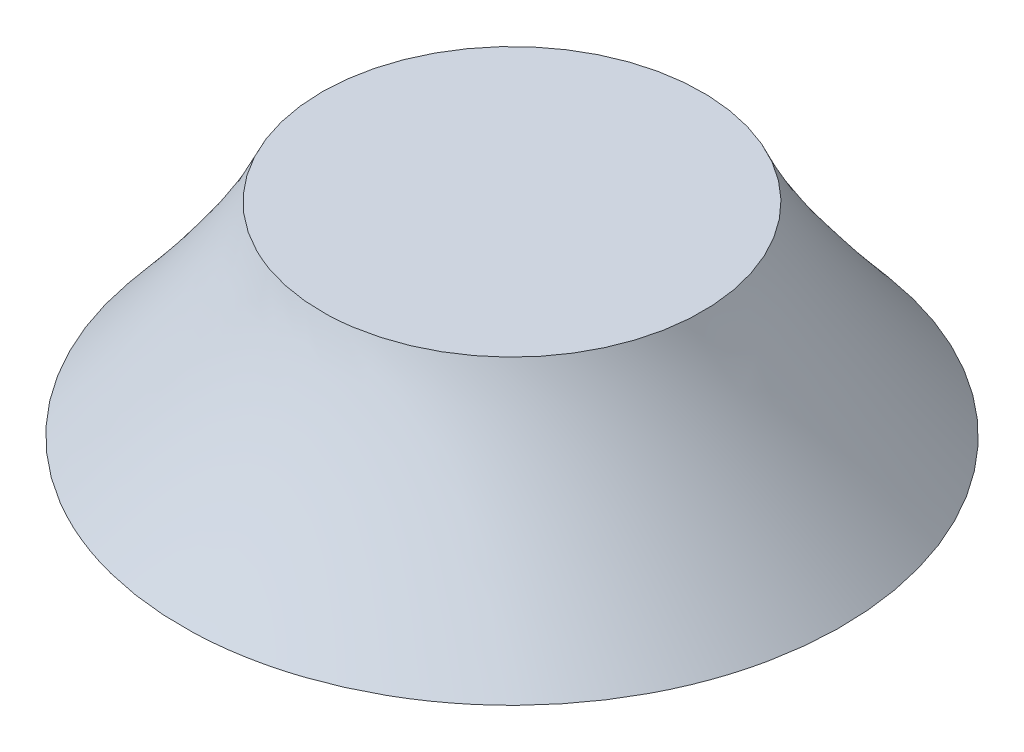
ISO-10303-21;
HEADER;
FILE_DESCRIPTION(('STEP AP214'),'2;1');
FILE_NAME('part.step','',(''),(''),'','','');
FILE_SCHEMA(('AUTOMOTIVE_DESIGN { 1 0 10303 214 1 1 1 1 }'));
ENDSEC;
DATA;
#1=APPLICATION_CONTEXT('core data for automotive mechanical design processes');
#2=APPLICATION_PROTOCOL_DEFINITION('international standard','automotive_design',2000,#1);
#3=PRODUCT_CONTEXT('',#1,'mechanical');
#4=PRODUCT('Part','Part','',(#3));
#5=PRODUCT_RELATED_PRODUCT_CATEGORY('part','',(#4));
#6=PRODUCT_DEFINITION_FORMATION('','',#4);
#7=PRODUCT_DEFINITION_CONTEXT('part definition',#1,'design');
#8=PRODUCT_DEFINITION('design','',#6,#7);
#9=PRODUCT_DEFINITION_SHAPE('','',#8);
#10=(LENGTH_UNIT() NAMED_UNIT(*) SI_UNIT(.MILLI.,.METRE.));
#11=(NAMED_UNIT(*) PLANE_ANGLE_UNIT() SI_UNIT($,.RADIAN.));
#12=(NAMED_UNIT(*) SI_UNIT($,.STERADIAN.) SOLID_ANGLE_UNIT());
#13=UNCERTAINTY_MEASURE_WITH_UNIT(LENGTH_MEASURE(1.E-05),#10,'distance_accuracy_value','');
#14=(GEOMETRIC_REPRESENTATION_CONTEXT(3) GLOBAL_UNCERTAINTY_ASSIGNED_CONTEXT((#13)) GLOBAL_UNIT_ASSIGNED_CONTEXT((#10,
#11,#12)) REPRESENTATION_CONTEXT('',''));
#15=CARTESIAN_POINT('',(0.,0.,0.));
#16=DIRECTION('',(0.,0.,1.));
#17=DIRECTION('',(1.,0.,0.));
#18=AXIS2_PLACEMENT_3D('',#15,#16,#17);
#19=CARTESIAN_POINT('',(0.,80.,0.));
#20=DIRECTION('',(0.,1.,0.));
#21=DIRECTION('',(0.,0.,1.));
#22=AXIS2_PLACEMENT_3D('',#19,#20,#21);
#23=PLANE('',#22);
#24=CARTESIAN_POINT('',(0.,80.,0.));
#25=DIRECTION('',(0.,1.,0.));
#26=DIRECTION('',(0.,0.,1.));
#27=AXIS2_PLACEMENT_3D('',#24,#25,#26);
#28=CIRCLE('',#27,75.);
#29=CARTESIAN_POINT('',(11.6394882057949,80.,-74.0913106531877));
#30=VERTEX_POINT('',#29);
#31=EDGE_CURVE('E11',#30,#30,#28,.T.);
#32=ORIENTED_EDGE('',*,*,#31,.T.);
#33=EDGE_LOOP('',(#32));
#34=FACE_BOUND('',#33,.T.);
#35=ADVANCED_FACE('F45',(#34),#23,.T.);
#36=CARTESIAN_POINT('',(0.,0.,0.));
#37=DIRECTION('',(0.,1.,0.));
#38=DIRECTION('',(0.,0.,1.));
#39=AXIS2_PLACEMENT_3D('',#36,#37,#38);
#40=PLANE('',#39);
#41=CARTESIAN_POINT('',(0.,0.,0.));
#42=DIRECTION('',(0.,1.,0.));
#43=DIRECTION('',(0.,0.,1.));
#44=AXIS2_PLACEMENT_3D('',#41,#42,#43);
#45=CIRCLE('',#44,130.);
#46=CARTESIAN_POINT('',(-52.6020180249039,0.,-118.882411229364));
#47=VERTEX_POINT('',#46);
#48=EDGE_CURVE('E54',#47,#47,#45,.T.);
#49=ORIENTED_EDGE('',*,*,#48,.F.);
#50=EDGE_LOOP('',(#49));
#51=FACE_BOUND('',#50,.T.);
#52=ADVANCED_FACE('F78',(#51),#40,.F.);
#53=CARTESIAN_POINT('',(-52.6020180249039,0.,-118.882411229364));
#54=CARTESIAN_POINT('',(11.6394882057949,80.,-74.0913106531877));
#55=CARTESIAN_POINT('',(-290.366840483633,0.,-13.6783751795564));
#56=CARTESIAN_POINT('',(-136.543133100581,80.,-97.3702870647776));
#57=CARTESIAN_POINT('',(-185.162804433825,0.,224.086447279172));
#58=CARTESIAN_POINT('',(-159.82210951217,80.,50.8123342415979));
#59=CARTESIAN_POINT('',(52.602018024904,0.,118.882411229364));
#60=CARTESIAN_POINT('',(-11.6394882057949,80.,74.0913106531877));
#61=CARTESIAN_POINT('',(290.366840483632,0.,13.6783751795563));
#62=CARTESIAN_POINT('',(136.54313310058,80.,97.3702870647775));
#63=CARTESIAN_POINT('',(185.162804433825,0.,-224.086447279172));
#64=CARTESIAN_POINT('',(159.82210951217,80.,-50.8123342415979));
#65=CARTESIAN_POINT('',(-52.6020180249039,0.,-118.882411229364));
#66=CARTESIAN_POINT('',(11.6394882057949,80.,-74.0913106531877));
#67=(BOUNDED_SURFACE() B_SPLINE_SURFACE(3,1,((#53,#54),(#55,#56),(#57,#58),(#59,#60),(#61,#62),
(#63,#64),(#65,#66)),.UNSPECIFIED.,.T.,.F.,.F.) B_SPLINE_SURFACE_WITH_KNOTS((4,3,4),(2,2),(0.,
0.5,1.),(0.,1.),.UNSPECIFIED.) GEOMETRIC_REPRESENTATION_ITEM() RATIONAL_B_SPLINE_SURFACE(((1.,
1.),(0.333333333333333,0.333333333333333),(0.333333333333333,0.333333333333333),(1.,1.),
(0.333333333333333,0.333333333333333),(0.333333333333333,0.333333333333333),(1.,1.))) REPRESENTATION_ITEM('') SURFACE());
#68=CARTESIAN_POINT('',(-52.6020180249039,0.,-118.882411229364));
#69=CARTESIAN_POINT('',(-51.9328356683341,0.833333333333335,-118.415837265029));
#70=CARTESIAN_POINT('',(-51.2636533117644,1.66666666666667,-117.949263300694));
#71=CARTESIAN_POINT('',(-49.9252885986248,3.33333333333333,-117.016115372024));
#72=CARTESIAN_POINT('',(-49.256106242055,4.16666666666667,-116.549541407688));
#73=CARTESIAN_POINT('',(-47.9177415289155,5.83333333333333,-115.616393479018));
#74=CARTESIAN_POINT('',(-47.2485591723457,6.66666666666667,-115.149819514683));
#75=CARTESIAN_POINT('',(-45.9101944592061,8.33333333333333,-114.216671586013));
#76=CARTESIAN_POINT('',(-45.2410121026363,9.16666666666667,-113.750097621677));
#77=CARTESIAN_POINT('',(-43.9026473894968,10.8333333333333,-112.816949693007));
#78=CARTESIAN_POINT('',(-43.233465032927,11.6666666666667,-112.350375728672));
#79=CARTESIAN_POINT('',(-41.8951003197874,13.3333333333333,-111.417227800002));
#80=CARTESIAN_POINT('',(-41.2259179632177,14.1666666666667,-110.950653835666));
#81=CARTESIAN_POINT('',(-39.8875532500781,15.8333333333333,-110.017505906996));
#82=CARTESIAN_POINT('',(-39.2183708935083,16.6666666666667,-109.550931942661));
#83=CARTESIAN_POINT('',(-37.8800061803688,18.3333333333333,-108.617784013991));
#84=CARTESIAN_POINT('',(-37.210823823799,19.1666666666667,-108.151210049655));
#85=CARTESIAN_POINT('',(-35.8724591106594,20.8333333333333,-107.218062120985));
#86=CARTESIAN_POINT('',(-35.2032767540896,21.6666666666667,-106.75148815665));
#87=CARTESIAN_POINT('',(-33.8649120409501,23.3333333333333,-105.818340227979));
#88=CARTESIAN_POINT('',(-33.1957296843803,24.1666666666667,-105.351766263644));
#89=CARTESIAN_POINT('',(-31.8573649712407,25.8333333333333,-104.418618334974));
#90=CARTESIAN_POINT('',(-31.188182614671,26.6666666666667,-103.952044370639));
#91=CARTESIAN_POINT('',(-29.8498179015314,28.3333333333333,-103.018896441968));
#92=CARTESIAN_POINT('',(-29.1806355449616,29.1666666666667,-102.552322477633));
#93=CARTESIAN_POINT('',(-27.8422708318221,30.8333333333333,-101.619174548963));
#94=CARTESIAN_POINT('',(-27.1730884752523,31.6666666666667,-101.152600584628));
#95=CARTESIAN_POINT('',(-25.8347237621127,33.3333333333333,-100.219452655957));
#96=CARTESIAN_POINT('',(-25.1655414055429,34.1666666666667,-99.7528786916222));
#97=CARTESIAN_POINT('',(-23.8271766924034,35.8333333333333,-98.8197307629519));
#98=CARTESIAN_POINT('',(-23.1579943358336,36.6666666666667,-98.3531567986167));
#99=CARTESIAN_POINT('',(-21.819629622694,38.3333333333333,-97.4200088699463));
#100=CARTESIAN_POINT('',(-21.1504472661243,39.1666666666667,-96.9534349056112));
#101=CARTESIAN_POINT('',(-19.8120825529847,40.8333333333333,-96.0202869769408));
#102=CARTESIAN_POINT('',(-19.1429001964149,41.6666666666667,-95.5537130126057));
#103=CARTESIAN_POINT('',(-17.8045354832754,43.3333333333333,-94.6205650839353));
#104=CARTESIAN_POINT('',(-17.1353531267056,44.1666666666667,-94.1539911196001));
#105=CARTESIAN_POINT('',(-15.796988413566,45.8333333333333,-93.2208431909298));
#106=CARTESIAN_POINT('',(-15.1278060569963,46.6666666666667,-92.7542692265946));
#107=CARTESIAN_POINT('',(-13.7894413438567,48.3333333333333,-91.8211212979243));
#108=CARTESIAN_POINT('',(-13.1202589872869,49.1666666666667,-91.3545473335891));
#109=CARTESIAN_POINT('',(-11.7818942741473,50.8333333333333,-90.4213994049187));
#110=CARTESIAN_POINT('',(-11.1127119175776,51.6666666666667,-89.9548254405836));
#111=CARTESIAN_POINT('',(-9.77434720443801,53.3333333333333,-89.0216775119132));
#112=CARTESIAN_POINT('',(-9.10516484786823,54.1666666666667,-88.555103547578));
#113=CARTESIAN_POINT('',(-7.76680013472867,55.8333333333333,-87.6219556189077));
#114=CARTESIAN_POINT('',(-7.09761777815889,56.6666666666667,-87.1553816545725));
#115=CARTESIAN_POINT('',(-5.75925306501933,58.3333333333333,-86.2222337259022));
#116=CARTESIAN_POINT('',(-5.09007070844955,59.1666666666667,-85.755659761567));
#117=CARTESIAN_POINT('',(-3.75170599530999,60.8333333333333,-84.8225118328967));
#118=CARTESIAN_POINT('',(-3.08252363874021,61.6666666666667,-84.3559378685615));
#119=CARTESIAN_POINT('',(-1.74415892560065,63.3333333333333,-83.4227899398911));
#120=CARTESIAN_POINT('',(-1.07497656903087,64.1666666666667,-82.956215975556));
#121=CARTESIAN_POINT('',(0.263388144108688,65.8333333333333,-82.0230680468856));
#122=CARTESIAN_POINT('',(0.932570500678468,66.6666666666667,-81.5564940825505));
#123=CARTESIAN_POINT('',(2.27093521381803,68.3333333333333,-80.6233461538801));
#124=CARTESIAN_POINT('',(2.94011757038781,69.1666666666667,-80.1567721895449));
#125=CARTESIAN_POINT('',(4.27848228352737,70.8333333333333,-79.2236242608746));
#126=CARTESIAN_POINT('',(4.94766464009715,71.6666666666667,-78.7570502965394));
#127=CARTESIAN_POINT('',(6.28602935323671,73.3333333333333,-77.8239023678691));
#128=CARTESIAN_POINT('',(6.95521170980649,74.1666666666667,-77.3573284035339));
#129=CARTESIAN_POINT('',(8.29357642294604,75.8333333333333,-76.4241804748635));
#130=CARTESIAN_POINT('',(8.96275877951583,76.6666666666667,-75.9576065105284));
#131=CARTESIAN_POINT('',(10.3011234926554,78.3333333333333,-75.024458581858));
#132=CARTESIAN_POINT('',(10.9703058492252,79.1666666666667,-74.5578846175229));
#133=CARTESIAN_POINT('',(11.6394882057949,80.,-74.0913106531877));
#134=B_SPLINE_CURVE_WITH_KNOTS('',3,(#68,#69,#70,#71,#72,#73,#74,#75,#76,#77,#78,#79,#80,#81,
#82,#83,#84,#85,#86,#87,#88,#89,#90,#91,#92,#93,#94,#95,#96,#97,#98,#99,#100,#101,#102,#103,
#104,#105,#106,#107,#108,#109,#110,#111,#112,#113,#114,#115,#116,#117,#118,#119,#120,#121,#122,
#123,#124,#125,#126,#127,#128,#129,#130,#131,#132,#133),.UNSPECIFIED.,.F.,.F.,(4,2,2,2,2,2,2,2,
2,2,2,2,2,2,2,2,2,2,2,2,2,2,2,2,2,2,2,2,2,2,2,2,4),(0.,3.49849490707897,6.99698981415794,
10.4954847212369,13.9939796283159,17.4924745353949,20.9909694424738,24.4894643495528,
27.9879592566318,31.4864541637108,34.9849490707897,38.4834439778687,41.9819388849477,
45.4804337920266,48.9789286991056,52.4774236061846,55.9759185132636,59.4744134203425,
62.9729083274215,66.4714032345005,69.9698981415795,73.4683930486584,76.9668879557374,
80.4653828628164,83.9638777698953,87.4623726769743,90.9608675840533,94.4593624911323,
97.9578573982112,101.45635230529,104.954847212369,108.453342119448,111.951837026527),.UNSPECIFIED.);
#135=EDGE_CURVE('BSEAM86',#47,#30,#134,.T.);
#136=ORIENTED_EDGE('',*,*,#48,.T.);
#137=ORIENTED_EDGE('',*,*,#31,.F.);
#138=ORIENTED_EDGE('',*,*,#135,.T.);
#139=ORIENTED_EDGE('',*,*,#135,.F.);
#140=EDGE_LOOP('',(#136,#138,#137,#139));
#141=FACE_BOUND('',#140,.T.);
#142=ADVANCED_FACE('F86',(#141),#67,.T.);
#143=CLOSED_SHELL('',(#35,#52,#142));
#144=MANIFOLD_SOLID_BREP('B2',#143);
#145=ADVANCED_BREP_SHAPE_REPRESENTATION('',(#18,#144),#14);
#146=SHAPE_DEFINITION_REPRESENTATION(#9,#145);
ENDSEC;
END-ISO-10303-21;
